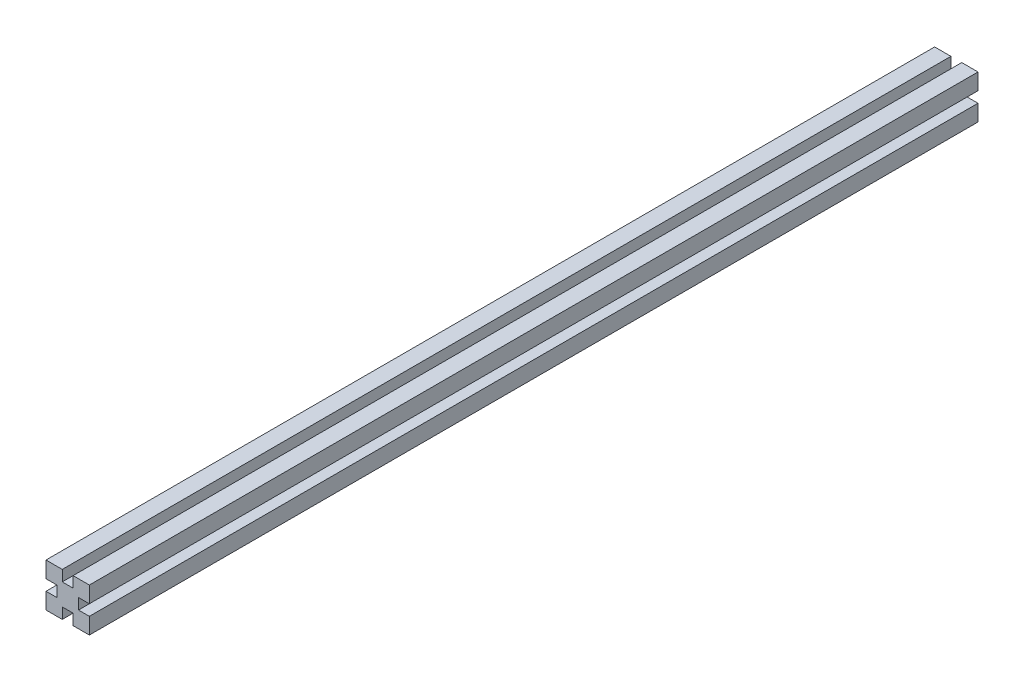
ISO-10303-21;
HEADER;
FILE_DESCRIPTION(('STEP AP214'),'2;1');
FILE_NAME('part.step','',(''),(''),'','','');
FILE_SCHEMA(('AUTOMOTIVE_DESIGN { 1 0 10303 214 1 1 1 1 }'));
ENDSEC;
DATA;
#1=APPLICATION_CONTEXT('core data for automotive mechanical design processes');
#2=APPLICATION_PROTOCOL_DEFINITION('international standard','automotive_design',2000,#1);
#3=PRODUCT_CONTEXT('',#1,'mechanical');
#4=PRODUCT('Part','Part','',(#3));
#5=PRODUCT_RELATED_PRODUCT_CATEGORY('part','',(#4));
#6=PRODUCT_DEFINITION_FORMATION('','',#4);
#7=PRODUCT_DEFINITION_CONTEXT('part definition',#1,'design');
#8=PRODUCT_DEFINITION('design','',#6,#7);
#9=PRODUCT_DEFINITION_SHAPE('','',#8);
#10=(LENGTH_UNIT() NAMED_UNIT(*) SI_UNIT(.MILLI.,.METRE.));
#11=(NAMED_UNIT(*) PLANE_ANGLE_UNIT() SI_UNIT($,.RADIAN.));
#12=(NAMED_UNIT(*) SI_UNIT($,.STERADIAN.) SOLID_ANGLE_UNIT());
#13=UNCERTAINTY_MEASURE_WITH_UNIT(LENGTH_MEASURE(1.E-05),#10,'distance_accuracy_value','');
#14=(GEOMETRIC_REPRESENTATION_CONTEXT(3) GLOBAL_UNCERTAINTY_ASSIGNED_CONTEXT((#13)) GLOBAL_UNIT_ASSIGNED_CONTEXT((#10,
#11,#12)) REPRESENTATION_CONTEXT('',''));
#15=CARTESIAN_POINT('',(0.,0.,0.));
#16=DIRECTION('',(0.,0.,1.));
#17=DIRECTION('',(1.,0.,0.));
#18=AXIS2_PLACEMENT_3D('',#15,#16,#17);
#19=CARTESIAN_POINT('',(0.,0.,-410.));
#20=DIRECTION('',(0.,0.,1.));
#21=DIRECTION('',(1.,0.,0.));
#22=AXIS2_PLACEMENT_3D('',#19,#20,#21);
#23=PLANE('',#22);
#24=DIRECTION('',(-1.,0.,0.));
#25=VECTOR('',#24,1.);
#26=CARTESIAN_POINT('',(0.,-2.5,-410.));
#27=LINE('',#26,#25);
#28=CARTESIAN_POINT('',(10.,-2.50000000000004,-410.));
#29=VERTEX_POINT('',#28);
#30=CARTESIAN_POINT('',(4.99999999999999,-2.50000000000002,-410.));
#31=VERTEX_POINT('',#30);
#32=EDGE_CURVE('E179',#29,#31,#27,.T.);
#33=ORIENTED_EDGE('',*,*,#32,.F.);
#34=DIRECTION('',(0.,-1.,0.));
#35=VECTOR('',#34,1.);
#36=CARTESIAN_POINT('',(10.,0.,-410.));
#37=LINE('',#36,#35);
#38=CARTESIAN_POINT('',(10.,-10.,-410.));
#39=VERTEX_POINT('',#38);
#40=EDGE_CURVE('E277',#29,#39,#37,.T.);
#41=ORIENTED_EDGE('',*,*,#40,.T.);
#42=DIRECTION('',(1.,0.,0.));
#43=VECTOR('',#42,1.);
#44=CARTESIAN_POINT('',(0.,-10.,-410.));
#45=LINE('',#44,#43);
#46=CARTESIAN_POINT('',(2.5,-10.,-410.));
#47=VERTEX_POINT('',#46);
#48=EDGE_CURVE('E273',#47,#39,#45,.T.);
#49=ORIENTED_EDGE('',*,*,#48,.F.);
#50=DIRECTION('',(0.,1.,0.));
#51=VECTOR('',#50,1.);
#52=CARTESIAN_POINT('',(2.5,0.,-410.));
#53=LINE('',#52,#51);
#54=CARTESIAN_POINT('',(2.5,-5.,-410.));
#55=VERTEX_POINT('',#54);
#56=EDGE_CURVE('E58',#47,#55,#53,.T.);
#57=ORIENTED_EDGE('',*,*,#56,.T.);
#58=DIRECTION('',(-1.,0.,0.));
#59=VECTOR('',#58,1.);
#60=CARTESIAN_POINT('',(0.,-5.,-410.));
#61=LINE('',#60,#59);
#62=CARTESIAN_POINT('',(-2.5,-5.,-410.));
#63=VERTEX_POINT('',#62);
#64=EDGE_CURVE('E239',#55,#63,#61,.T.);
#65=ORIENTED_EDGE('',*,*,#64,.T.);
#66=DIRECTION('',(0.,1.,0.));
#67=VECTOR('',#66,1.);
#68=CARTESIAN_POINT('',(-2.5,0.,-410.));
#69=LINE('',#68,#67);
#70=CARTESIAN_POINT('',(-2.5,-10.,-410.));
#71=VERTEX_POINT('',#70);
#72=EDGE_CURVE('E232',#71,#63,#69,.T.);
#73=ORIENTED_EDGE('',*,*,#72,.F.);
#74=CARTESIAN_POINT('',(-10.,-10.,-410.));
#75=VERTEX_POINT('',#74);
#76=EDGE_CURVE('E274',#75,#71,#45,.T.);
#77=ORIENTED_EDGE('',*,*,#76,.F.);
#78=DIRECTION('',(0.,-1.,0.));
#79=VECTOR('',#78,1.);
#80=CARTESIAN_POINT('',(-10.,0.,-410.));
#81=LINE('',#80,#79);
#82=CARTESIAN_POINT('',(-10.,-2.49999999999989,-410.));
#83=VERTEX_POINT('',#82);
#84=EDGE_CURVE('E268',#83,#75,#81,.T.);
#85=ORIENTED_EDGE('',*,*,#84,.F.);
#86=DIRECTION('',(1.,0.,0.));
#87=VECTOR('',#86,1.);
#88=CARTESIAN_POINT('',(0.,-2.5,-410.));
#89=LINE('',#88,#87);
#90=CARTESIAN_POINT('',(-5.00000000000002,-2.49999999999995,-410.));
#91=VERTEX_POINT('',#90);
#92=EDGE_CURVE('E182',#83,#91,#89,.T.);
#93=ORIENTED_EDGE('',*,*,#92,.T.);
#94=DIRECTION('',(0.,1.,0.));
#95=VECTOR('',#94,1.);
#96=CARTESIAN_POINT('',(-5.,0.,-410.));
#97=LINE('',#96,#95);
#98=CARTESIAN_POINT('',(-4.99999999999997,2.50000000000005,-410.));
#99=VERTEX_POINT('',#98);
#100=EDGE_CURVE('E236',#91,#99,#97,.T.);
#101=ORIENTED_EDGE('',*,*,#100,.T.);
#102=DIRECTION('',(1.,0.,0.));
#103=VECTOR('',#102,1.);
#104=CARTESIAN_POINT('',(0.,2.5,-410.));
#105=LINE('',#104,#103);
#106=CARTESIAN_POINT('',(-10.,2.5000000000001,-410.));
#107=VERTEX_POINT('',#106);
#108=EDGE_CURVE('E229',#107,#99,#105,.T.);
#109=ORIENTED_EDGE('',*,*,#108,.F.);
#110=CARTESIAN_POINT('',(-10.,10.,-410.));
#111=VERTEX_POINT('',#110);
#112=EDGE_CURVE('E270',#111,#107,#81,.T.);
#113=ORIENTED_EDGE('',*,*,#112,.F.);
#114=DIRECTION('',(1.,0.,0.));
#115=VECTOR('',#114,1.);
#116=CARTESIAN_POINT('',(0.,10.,-410.));
#117=LINE('',#116,#115);
#118=CARTESIAN_POINT('',(-2.5,10.,-410.));
#119=VERTEX_POINT('',#118);
#120=EDGE_CURVE('E265',#111,#119,#117,.T.);
#121=ORIENTED_EDGE('',*,*,#120,.T.);
#122=DIRECTION('',(0.,-1.,0.));
#123=VECTOR('',#122,1.);
#124=CARTESIAN_POINT('',(-2.5,0.,-410.));
#125=LINE('',#124,#123);
#126=CARTESIAN_POINT('',(-2.5,5.,-410.));
#127=VERTEX_POINT('',#126);
#128=EDGE_CURVE('E251',#119,#127,#125,.T.);
#129=ORIENTED_EDGE('',*,*,#128,.T.);
#130=DIRECTION('',(1.,0.,0.));
#131=VECTOR('',#130,1.);
#132=CARTESIAN_POINT('',(0.,5.,-410.));
#133=LINE('',#132,#131);
#134=CARTESIAN_POINT('',(2.5,5.,-410.));
#135=VERTEX_POINT('',#134);
#136=EDGE_CURVE('E257',#127,#135,#133,.T.);
#137=ORIENTED_EDGE('',*,*,#136,.T.);
#138=DIRECTION('',(0.,-1.,0.));
#139=VECTOR('',#138,1.);
#140=CARTESIAN_POINT('',(2.5,0.,-410.));
#141=LINE('',#140,#139);
#142=CARTESIAN_POINT('',(2.5,10.,-410.));
#143=VERTEX_POINT('',#142);
#144=EDGE_CURVE('E260',#143,#135,#141,.T.);
#145=ORIENTED_EDGE('',*,*,#144,.F.);
#146=CARTESIAN_POINT('',(10.,10.,-410.));
#147=VERTEX_POINT('',#146);
#148=EDGE_CURVE('E269',#143,#147,#117,.T.);
#149=ORIENTED_EDGE('',*,*,#148,.T.);
#150=CARTESIAN_POINT('',(10.,2.49999999999996,-410.));
#151=VERTEX_POINT('',#150);
#152=EDGE_CURVE('E278',#147,#151,#37,.T.);
#153=ORIENTED_EDGE('',*,*,#152,.T.);
#154=DIRECTION('',(-1.,0.,0.));
#155=VECTOR('',#154,1.);
#156=CARTESIAN_POINT('',(0.,2.5,-410.));
#157=LINE('',#156,#155);
#158=CARTESIAN_POINT('',(5.00000000000001,2.49999999999998,-410.));
#159=VERTEX_POINT('',#158);
#160=EDGE_CURVE('E50',#151,#159,#157,.T.);
#161=ORIENTED_EDGE('',*,*,#160,.T.);
#162=DIRECTION('',(0.,-1.,0.));
#163=VECTOR('',#162,1.);
#164=CARTESIAN_POINT('',(5.,0.,-410.));
#165=LINE('',#164,#163);
#166=EDGE_CURVE('E242',#159,#31,#165,.T.);
#167=ORIENTED_EDGE('',*,*,#166,.T.);
#168=EDGE_LOOP('',(#33,#41,#49,#57,#65,#73,#77,#85,#93,#101,#109,#113,#121,#129,#137,#145,#149,
#153,#161,#167));
#169=FACE_BOUND('',#168,.T.);
#170=ADVANCED_FACE('F35',(#169),#23,.F.);
#171=CARTESIAN_POINT('',(0.,0.,0.));
#172=DIRECTION('',(0.,0.,1.));
#173=DIRECTION('',(1.,0.,0.));
#174=AXIS2_PLACEMENT_3D('',#171,#172,#173);
#175=PLANE('',#174);
#176=DIRECTION('',(0.,-1.,0.));
#177=VECTOR('',#176,1.);
#178=CARTESIAN_POINT('',(10.,0.,0.));
#179=LINE('',#178,#177);
#180=CARTESIAN_POINT('',(10.,-2.50000000000004,0.));
#181=VERTEX_POINT('',#180);
#182=CARTESIAN_POINT('',(10.,-10.,0.));
#183=VERTEX_POINT('',#182);
#184=EDGE_CURVE('E196',#181,#183,#179,.T.);
#185=ORIENTED_EDGE('',*,*,#184,.F.);
#186=DIRECTION('',(-1.,0.,0.));
#187=VECTOR('',#186,1.);
#188=CARTESIAN_POINT('',(15.,-2.50000000000005,0.));
#189=LINE('',#188,#187);
#190=CARTESIAN_POINT('',(4.99999999999999,-2.50000000000002,0.));
#191=VERTEX_POINT('',#190);
#192=EDGE_CURVE('E176',#181,#191,#189,.T.);
#193=ORIENTED_EDGE('',*,*,#192,.T.);
#194=DIRECTION('',(0.,-1.,0.));
#195=VECTOR('',#194,1.);
#196=CARTESIAN_POINT('',(5.00000000000001,2.49999999999998,0.));
#197=LINE('',#196,#195);
#198=CARTESIAN_POINT('',(5.00000000000001,2.49999999999998,0.));
#199=VERTEX_POINT('',#198);
#200=EDGE_CURVE('E186',#199,#191,#197,.T.);
#201=ORIENTED_EDGE('',*,*,#200,.F.);
#202=DIRECTION('',(-1.,0.,0.));
#203=VECTOR('',#202,1.);
#204=CARTESIAN_POINT('',(15.,2.49999999999995,0.));
#205=LINE('',#204,#203);
#206=CARTESIAN_POINT('',(10.,2.49999999999996,0.));
#207=VERTEX_POINT('',#206);
#208=EDGE_CURVE('E191',#207,#199,#205,.T.);
#209=ORIENTED_EDGE('',*,*,#208,.F.);
#210=CARTESIAN_POINT('',(10.,10.,0.));
#211=VERTEX_POINT('',#210);
#212=EDGE_CURVE('E293',#211,#207,#179,.T.);
#213=ORIENTED_EDGE('',*,*,#212,.F.);
#214=DIRECTION('',(1.,0.,0.));
#215=VECTOR('',#214,1.);
#216=CARTESIAN_POINT('',(0.,10.,0.));
#217=LINE('',#216,#215);
#218=CARTESIAN_POINT('',(2.5,10.,0.));
#219=VERTEX_POINT('',#218);
#220=EDGE_CURVE('E264',#219,#211,#217,.T.);
#221=ORIENTED_EDGE('',*,*,#220,.F.);
#222=DIRECTION('',(0.,-1.,0.));
#223=VECTOR('',#222,1.);
#224=CARTESIAN_POINT('',(2.5,0.,0.));
#225=LINE('',#224,#223);
#226=CARTESIAN_POINT('',(2.5,5.,0.));
#227=VERTEX_POINT('',#226);
#228=EDGE_CURVE('E309',#219,#227,#225,.T.);
#229=ORIENTED_EDGE('',*,*,#228,.T.);
#230=DIRECTION('',(1.,0.,0.));
#231=VECTOR('',#230,1.);
#232=CARTESIAN_POINT('',(-2.5,5.,0.));
#233=LINE('',#232,#231);
#234=CARTESIAN_POINT('',(-2.5,5.,0.));
#235=VERTEX_POINT('',#234);
#236=EDGE_CURVE('E244',#235,#227,#233,.T.);
#237=ORIENTED_EDGE('',*,*,#236,.F.);
#238=DIRECTION('',(0.,-1.,0.));
#239=VECTOR('',#238,1.);
#240=CARTESIAN_POINT('',(-2.5,0.,0.));
#241=LINE('',#240,#239);
#242=CARTESIAN_POINT('',(-2.5,10.,0.));
#243=VERTEX_POINT('',#242);
#244=EDGE_CURVE('E299',#243,#235,#241,.T.);
#245=ORIENTED_EDGE('',*,*,#244,.F.);
#246=CARTESIAN_POINT('',(-10.,10.,0.));
#247=VERTEX_POINT('',#246);
#248=EDGE_CURVE('E282',#247,#243,#217,.T.);
#249=ORIENTED_EDGE('',*,*,#248,.F.);
#250=DIRECTION('',(0.,-1.,0.));
#251=VECTOR('',#250,1.);
#252=CARTESIAN_POINT('',(-10.,0.,0.));
#253=LINE('',#252,#251);
#254=CARTESIAN_POINT('',(-10.,2.50000000000011,0.));
#255=VERTEX_POINT('',#254);
#256=EDGE_CURVE('E286',#247,#255,#253,.T.);
#257=ORIENTED_EDGE('',*,*,#256,.T.);
#258=DIRECTION('',(1.,0.,0.));
#259=VECTOR('',#258,1.);
#260=CARTESIAN_POINT('',(-15.,2.50000000000016,0.));
#261=LINE('',#260,#259);
#262=CARTESIAN_POINT('',(-4.99999999999997,2.50000000000005,0.));
#263=VERTEX_POINT('',#262);
#264=EDGE_CURVE('E215',#255,#263,#261,.T.);
#265=ORIENTED_EDGE('',*,*,#264,.T.);
#266=DIRECTION('',(0.,1.,0.));
#267=VECTOR('',#266,1.);
#268=CARTESIAN_POINT('',(-5.00000000000002,-2.49999999999995,0.));
#269=LINE('',#268,#267);
#270=CARTESIAN_POINT('',(-5.00000000000002,-2.49999999999995,0.));
#271=VERTEX_POINT('',#270);
#272=EDGE_CURVE('E218',#271,#263,#269,.T.);
#273=ORIENTED_EDGE('',*,*,#272,.F.);
#274=DIRECTION('',(1.,0.,0.));
#275=VECTOR('',#274,1.);
#276=CARTESIAN_POINT('',(-15.,-2.49999999999984,0.));
#277=LINE('',#276,#275);
#278=CARTESIAN_POINT('',(-10.,-2.49999999999989,0.));
#279=VERTEX_POINT('',#278);
#280=EDGE_CURVE('E221',#279,#271,#277,.T.);
#281=ORIENTED_EDGE('',*,*,#280,.F.);
#282=CARTESIAN_POINT('',(-10.,-10.,0.));
#283=VERTEX_POINT('',#282);
#284=EDGE_CURVE('E285',#279,#283,#253,.T.);
#285=ORIENTED_EDGE('',*,*,#284,.T.);
#286=DIRECTION('',(1.,0.,0.));
#287=VECTOR('',#286,1.);
#288=CARTESIAN_POINT('',(0.,-10.,0.));
#289=LINE('',#288,#287);
#290=CARTESIAN_POINT('',(-2.5,-10.,0.));
#291=VERTEX_POINT('',#290);
#292=EDGE_CURVE('E290',#283,#291,#289,.T.);
#293=ORIENTED_EDGE('',*,*,#292,.T.);
#294=DIRECTION('',(0.,1.,0.));
#295=VECTOR('',#294,1.);
#296=CARTESIAN_POINT('',(-2.5,-15.,0.));
#297=LINE('',#296,#295);
#298=CARTESIAN_POINT('',(-2.5,-5.,0.));
#299=VERTEX_POINT('',#298);
#300=EDGE_CURVE('E204',#291,#299,#297,.T.);
#301=ORIENTED_EDGE('',*,*,#300,.T.);
#302=DIRECTION('',(-1.,0.,0.));
#303=VECTOR('',#302,1.);
#304=CARTESIAN_POINT('',(2.5,-5.,0.));
#305=LINE('',#304,#303);
#306=CARTESIAN_POINT('',(2.5,-5.,0.));
#307=VERTEX_POINT('',#306);
#308=EDGE_CURVE('E207',#307,#299,#305,.T.);
#309=ORIENTED_EDGE('',*,*,#308,.F.);
#310=DIRECTION('',(0.,1.,0.));
#311=VECTOR('',#310,1.);
#312=CARTESIAN_POINT('',(2.5,-15.,0.));
#313=LINE('',#312,#311);
#314=CARTESIAN_POINT('',(2.5,-10.,0.));
#315=VERTEX_POINT('',#314);
#316=EDGE_CURVE('E211',#315,#307,#313,.T.);
#317=ORIENTED_EDGE('',*,*,#316,.F.);
#318=EDGE_CURVE('E289',#315,#183,#289,.T.);
#319=ORIENTED_EDGE('',*,*,#318,.T.);
#320=EDGE_LOOP('',(#185,#193,#201,#209,#213,#221,#229,#237,#245,#249,#257,#265,#273,#281,#285,
#293,#301,#309,#317,#319));
#321=FACE_BOUND('',#320,.T.);
#322=ADVANCED_FACE('F194',(#321),#175,.T.);
#323=CARTESIAN_POINT('',(10.,0.,-410.));
#324=DIRECTION('',(-1.,0.,0.));
#325=DIRECTION('',(0.,0.,1.));
#326=AXIS2_PLACEMENT_3D('',#323,#324,#325);
#327=PLANE('',#326);
#328=DIRECTION('',(0.,0.,-1.));
#329=VECTOR('',#328,1.);
#330=CARTESIAN_POINT('',(10.,-2.50000000000004,-410.));
#331=LINE('',#330,#329);
#332=EDGE_CURVE('E11',#181,#29,#331,.T.);
#333=ORIENTED_EDGE('',*,*,#332,.F.);
#334=ORIENTED_EDGE('',*,*,#184,.T.);
#335=DIRECTION('',(0.,0.,1.));
#336=VECTOR('',#335,1.);
#337=CARTESIAN_POINT('',(10.,-10.,-410.));
#338=LINE('',#337,#336);
#339=EDGE_CURVE('E300',#39,#183,#338,.T.);
#340=ORIENTED_EDGE('',*,*,#339,.F.);
#341=ORIENTED_EDGE('',*,*,#40,.F.);
#342=EDGE_LOOP('',(#333,#334,#340,#341));
#343=FACE_BOUND('',#342,.T.);
#344=ADVANCED_FACE('F346',(#343),#327,.F.);
#345=CARTESIAN_POINT('',(0.,-10.,-410.));
#346=DIRECTION('',(0.,-1.,0.));
#347=DIRECTION('',(0.,0.,-1.));
#348=AXIS2_PLACEMENT_3D('',#345,#346,#347);
#349=PLANE('',#348);
#350=ORIENTED_EDGE('',*,*,#76,.T.);
#351=DIRECTION('',(0.,0.,1.));
#352=VECTOR('',#351,1.);
#353=CARTESIAN_POINT('',(-2.5,-10.,-410.));
#354=LINE('',#353,#352);
#355=EDGE_CURVE('E319',#71,#291,#354,.T.);
#356=ORIENTED_EDGE('',*,*,#355,.T.);
#357=ORIENTED_EDGE('',*,*,#292,.F.);
#358=DIRECTION('',(0.,0.,1.));
#359=VECTOR('',#358,1.);
#360=CARTESIAN_POINT('',(-10.,-10.,-410.));
#361=LINE('',#360,#359);
#362=EDGE_CURVE('E303',#75,#283,#361,.T.);
#363=ORIENTED_EDGE('',*,*,#362,.F.);
#364=EDGE_LOOP('',(#350,#356,#357,#363));
#365=FACE_BOUND('',#364,.T.);
#366=ADVANCED_FACE('F358',(#365),#349,.T.);
#367=CARTESIAN_POINT('',(-10.,0.,-410.));
#368=DIRECTION('',(-1.,0.,0.));
#369=DIRECTION('',(0.,-1.,0.));
#370=AXIS2_PLACEMENT_3D('',#367,#368,#369);
#371=PLANE('',#370);
#372=ORIENTED_EDGE('',*,*,#112,.T.);
#373=DIRECTION('',(0.,0.,1.));
#374=VECTOR('',#373,1.);
#375=CARTESIAN_POINT('',(-10.,2.5000000000001,-410.));
#376=LINE('',#375,#374);
#377=EDGE_CURVE('E314',#107,#255,#376,.T.);
#378=ORIENTED_EDGE('',*,*,#377,.T.);
#379=ORIENTED_EDGE('',*,*,#256,.F.);
#380=DIRECTION('',(0.,0.,1.));
#381=VECTOR('',#380,1.);
#382=CARTESIAN_POINT('',(-10.,10.,-410.));
#383=LINE('',#382,#381);
#384=EDGE_CURVE('E281',#111,#247,#383,.T.);
#385=ORIENTED_EDGE('',*,*,#384,.F.);
#386=EDGE_LOOP('',(#372,#378,#379,#385));
#387=FACE_BOUND('',#386,.T.);
#388=ADVANCED_FACE('F361',(#387),#371,.T.);
#389=CARTESIAN_POINT('',(0.,10.,-410.));
#390=DIRECTION('',(0.,-1.,0.));
#391=DIRECTION('',(0.,0.,-1.));
#392=AXIS2_PLACEMENT_3D('',#389,#390,#391);
#393=PLANE('',#392);
#394=DIRECTION('',(0.,0.,-1.));
#395=VECTOR('',#394,1.);
#396=CARTESIAN_POINT('',(2.5,10.,-410.));
#397=LINE('',#396,#395);
#398=EDGE_CURVE('E262',#219,#143,#397,.T.);
#399=ORIENTED_EDGE('',*,*,#398,.F.);
#400=ORIENTED_EDGE('',*,*,#220,.T.);
#401=DIRECTION('',(0.,0.,1.));
#402=VECTOR('',#401,1.);
#403=CARTESIAN_POINT('',(10.,10.,-410.));
#404=LINE('',#403,#402);
#405=EDGE_CURVE('E296',#147,#211,#404,.T.);
#406=ORIENTED_EDGE('',*,*,#405,.F.);
#407=ORIENTED_EDGE('',*,*,#148,.F.);
#408=EDGE_LOOP('',(#399,#400,#406,#407));
#409=FACE_BOUND('',#408,.T.);
#410=ADVANCED_FACE('F331',(#409),#393,.F.);
#411=ORIENTED_EDGE('',*,*,#248,.T.);
#412=DIRECTION('',(0.,0.,-1.));
#413=VECTOR('',#412,1.);
#414=CARTESIAN_POINT('',(-2.5,10.,-410.));
#415=LINE('',#414,#413);
#416=EDGE_CURVE('E254',#243,#119,#415,.T.);
#417=ORIENTED_EDGE('',*,*,#416,.T.);
#418=ORIENTED_EDGE('',*,*,#120,.F.);
#419=ORIENTED_EDGE('',*,*,#384,.T.);
#420=EDGE_LOOP('',(#411,#417,#418,#419));
#421=FACE_BOUND('',#420,.T.);
#422=ADVANCED_FACE('F37',(#421),#393,.F.);
#423=ORIENTED_EDGE('',*,*,#212,.T.);
#424=DIRECTION('',(0.,0.,-1.));
#425=VECTOR('',#424,1.);
#426=CARTESIAN_POINT('',(10.,2.49999999999996,-410.));
#427=LINE('',#426,#425);
#428=EDGE_CURVE('E43',#207,#151,#427,.T.);
#429=ORIENTED_EDGE('',*,*,#428,.T.);
#430=ORIENTED_EDGE('',*,*,#152,.F.);
#431=ORIENTED_EDGE('',*,*,#405,.T.);
#432=EDGE_LOOP('',(#423,#429,#430,#431));
#433=FACE_BOUND('',#432,.T.);
#434=ADVANCED_FACE('F323',(#433),#327,.F.);
#435=DIRECTION('',(0.,0.,1.));
#436=VECTOR('',#435,1.);
#437=CARTESIAN_POINT('',(2.5,-10.,-410.));
#438=LINE('',#437,#436);
#439=EDGE_CURVE('E317',#47,#315,#438,.T.);
#440=ORIENTED_EDGE('',*,*,#439,.F.);
#441=ORIENTED_EDGE('',*,*,#48,.T.);
#442=ORIENTED_EDGE('',*,*,#339,.T.);
#443=ORIENTED_EDGE('',*,*,#318,.F.);
#444=EDGE_LOOP('',(#440,#441,#442,#443));
#445=FACE_BOUND('',#444,.T.);
#446=ADVANCED_FACE('F354',(#445),#349,.T.);
#447=DIRECTION('',(0.,0.,1.));
#448=VECTOR('',#447,1.);
#449=CARTESIAN_POINT('',(-10.,-2.49999999999989,-410.));
#450=LINE('',#449,#448);
#451=EDGE_CURVE('E312',#83,#279,#450,.T.);
#452=ORIENTED_EDGE('',*,*,#451,.F.);
#453=ORIENTED_EDGE('',*,*,#84,.T.);
#454=ORIENTED_EDGE('',*,*,#362,.T.);
#455=ORIENTED_EDGE('',*,*,#284,.F.);
#456=EDGE_LOOP('',(#452,#453,#454,#455));
#457=FACE_BOUND('',#456,.T.);
#458=ADVANCED_FACE('F356',(#457),#371,.T.);
#459=CARTESIAN_POINT('',(2.5,15.,-645.));
#460=DIRECTION('',(-1.,0.,0.));
#461=DIRECTION('',(0.,-1.,0.));
#462=AXIS2_PLACEMENT_3D('',#459,#460,#461);
#463=PLANE('',#462);
#464=ORIENTED_EDGE('',*,*,#398,.T.);
#465=ORIENTED_EDGE('',*,*,#144,.T.);
#466=DIRECTION('',(0.,0.,1.));
#467=VECTOR('',#466,1.);
#468=CARTESIAN_POINT('',(2.5,5.,-645.));
#469=LINE('',#468,#467);
#470=EDGE_CURVE('E249',#135,#227,#469,.T.);
#471=ORIENTED_EDGE('',*,*,#470,.T.);
#472=ORIENTED_EDGE('',*,*,#228,.F.);
#473=EDGE_LOOP('',(#464,#465,#471,#472));
#474=FACE_BOUND('',#473,.T.);
#475=ADVANCED_FACE('F349',(#474),#463,.T.);
#476=CARTESIAN_POINT('',(-2.5,5.,-645.));
#477=DIRECTION('',(0.,-1.,0.));
#478=DIRECTION('',(0.,0.,-1.));
#479=AXIS2_PLACEMENT_3D('',#476,#477,#478);
#480=PLANE('',#479);
#481=DIRECTION('',(0.,0.,1.));
#482=VECTOR('',#481,1.);
#483=CARTESIAN_POINT('',(-2.5,5.,-645.));
#484=LINE('',#483,#482);
#485=EDGE_CURVE('E247',#127,#235,#484,.T.);
#486=ORIENTED_EDGE('',*,*,#485,.T.);
#487=ORIENTED_EDGE('',*,*,#236,.T.);
#488=ORIENTED_EDGE('',*,*,#470,.F.);
#489=ORIENTED_EDGE('',*,*,#136,.F.);
#490=EDGE_LOOP('',(#486,#487,#488,#489));
#491=FACE_BOUND('',#490,.T.);
#492=ADVANCED_FACE('F365',(#491),#480,.F.);
#493=CARTESIAN_POINT('',(-2.5,15.,-645.));
#494=DIRECTION('',(-1.,0.,0.));
#495=DIRECTION('',(0.,-1.,0.));
#496=AXIS2_PLACEMENT_3D('',#493,#494,#495);
#497=PLANE('',#496);
#498=ORIENTED_EDGE('',*,*,#244,.T.);
#499=ORIENTED_EDGE('',*,*,#485,.F.);
#500=ORIENTED_EDGE('',*,*,#128,.F.);
#501=ORIENTED_EDGE('',*,*,#416,.F.);
#502=EDGE_LOOP('',(#498,#499,#500,#501));
#503=FACE_BOUND('',#502,.T.);
#504=ADVANCED_FACE('F392',(#503),#497,.F.);
#505=CARTESIAN_POINT('',(-5.00000000000002,-2.49999999999995,-645.));
#506=DIRECTION('',(1.,0.,0.));
#507=DIRECTION('',(0.,1.,0.));
#508=AXIS2_PLACEMENT_3D('',#505,#506,#507);
#509=PLANE('',#508);
#510=DIRECTION('',(0.,0.,1.));
#511=VECTOR('',#510,1.);
#512=CARTESIAN_POINT('',(-5.00000000000002,-2.49999999999995,-645.));
#513=LINE('',#512,#511);
#514=EDGE_CURVE('E224',#91,#271,#513,.T.);
#515=ORIENTED_EDGE('',*,*,#514,.T.);
#516=ORIENTED_EDGE('',*,*,#272,.T.);
#517=DIRECTION('',(0.,0.,1.));
#518=VECTOR('',#517,1.);
#519=CARTESIAN_POINT('',(-4.99999999999997,2.50000000000005,-645.));
#520=LINE('',#519,#518);
#521=EDGE_CURVE('E208',#99,#263,#520,.T.);
#522=ORIENTED_EDGE('',*,*,#521,.F.);
#523=ORIENTED_EDGE('',*,*,#100,.F.);
#524=EDGE_LOOP('',(#515,#516,#522,#523));
#525=FACE_BOUND('',#524,.T.);
#526=ADVANCED_FACE('F383',(#525),#509,.F.);
#527=CARTESIAN_POINT('',(-15.,2.50000000000016,-645.));
#528=DIRECTION('',(0.,-1.,0.));
#529=DIRECTION('',(1.,0.,0.));
#530=AXIS2_PLACEMENT_3D('',#527,#528,#529);
#531=PLANE('',#530);
#532=ORIENTED_EDGE('',*,*,#108,.T.);
#533=ORIENTED_EDGE('',*,*,#521,.T.);
#534=ORIENTED_EDGE('',*,*,#264,.F.);
#535=ORIENTED_EDGE('',*,*,#377,.F.);
#536=EDGE_LOOP('',(#532,#533,#534,#535));
#537=FACE_BOUND('',#536,.T.);
#538=ADVANCED_FACE('F381',(#537),#531,.T.);
#539=CARTESIAN_POINT('',(-15.,-2.49999999999984,-645.));
#540=DIRECTION('',(0.,-1.,0.));
#541=DIRECTION('',(1.,0.,0.));
#542=AXIS2_PLACEMENT_3D('',#539,#540,#541);
#543=PLANE('',#542);
#544=ORIENTED_EDGE('',*,*,#451,.T.);
#545=ORIENTED_EDGE('',*,*,#280,.T.);
#546=ORIENTED_EDGE('',*,*,#514,.F.);
#547=ORIENTED_EDGE('',*,*,#92,.F.);
#548=EDGE_LOOP('',(#544,#545,#546,#547));
#549=FACE_BOUND('',#548,.T.);
#550=ADVANCED_FACE('F404',(#549),#543,.F.);
#551=CARTESIAN_POINT('',(2.5,-5.,-645.));
#552=DIRECTION('',(0.,1.,0.));
#553=DIRECTION('',(0.,0.,1.));
#554=AXIS2_PLACEMENT_3D('',#551,#552,#553);
#555=PLANE('',#554);
#556=DIRECTION('',(0.,0.,1.));
#557=VECTOR('',#556,1.);
#558=CARTESIAN_POINT('',(2.5,-5.,-645.));
#559=LINE('',#558,#557);
#560=EDGE_CURVE('E199',#55,#307,#559,.T.);
#561=ORIENTED_EDGE('',*,*,#560,.T.);
#562=ORIENTED_EDGE('',*,*,#308,.T.);
#563=DIRECTION('',(0.,0.,1.));
#564=VECTOR('',#563,1.);
#565=CARTESIAN_POINT('',(-2.5,-5.,-645.));
#566=LINE('',#565,#564);
#567=EDGE_CURVE('E197',#63,#299,#566,.T.);
#568=ORIENTED_EDGE('',*,*,#567,.F.);
#569=ORIENTED_EDGE('',*,*,#64,.F.);
#570=EDGE_LOOP('',(#561,#562,#568,#569));
#571=FACE_BOUND('',#570,.T.);
#572=ADVANCED_FACE('F409',(#571),#555,.F.);
#573=CARTESIAN_POINT('',(-2.5,-15.,-645.));
#574=DIRECTION('',(1.,0.,0.));
#575=DIRECTION('',(0.,1.,0.));
#576=AXIS2_PLACEMENT_3D('',#573,#574,#575);
#577=PLANE('',#576);
#578=ORIENTED_EDGE('',*,*,#72,.T.);
#579=ORIENTED_EDGE('',*,*,#567,.T.);
#580=ORIENTED_EDGE('',*,*,#300,.F.);
#581=ORIENTED_EDGE('',*,*,#355,.F.);
#582=EDGE_LOOP('',(#578,#579,#580,#581));
#583=FACE_BOUND('',#582,.T.);
#584=ADVANCED_FACE('F411',(#583),#577,.T.);
#585=CARTESIAN_POINT('',(2.5,-15.,-645.));
#586=DIRECTION('',(1.,0.,0.));
#587=DIRECTION('',(0.,1.,0.));
#588=AXIS2_PLACEMENT_3D('',#585,#586,#587);
#589=PLANE('',#588);
#590=ORIENTED_EDGE('',*,*,#439,.T.);
#591=ORIENTED_EDGE('',*,*,#316,.T.);
#592=ORIENTED_EDGE('',*,*,#560,.F.);
#593=ORIENTED_EDGE('',*,*,#56,.F.);
#594=EDGE_LOOP('',(#590,#591,#592,#593));
#595=FACE_BOUND('',#594,.T.);
#596=ADVANCED_FACE('F414',(#595),#589,.F.);
#597=CARTESIAN_POINT('',(5.00000000000001,2.49999999999998,-645.));
#598=DIRECTION('',(-1.,0.,0.));
#599=DIRECTION('',(0.,-1.,0.));
#600=AXIS2_PLACEMENT_3D('',#597,#598,#599);
#601=PLANE('',#600);
#602=DIRECTION('',(0.,0.,1.));
#603=VECTOR('',#602,1.);
#604=CARTESIAN_POINT('',(5.00000000000001,2.49999999999998,-645.));
#605=LINE('',#604,#603);
#606=EDGE_CURVE('E183',#159,#199,#605,.T.);
#607=ORIENTED_EDGE('',*,*,#606,.T.);
#608=ORIENTED_EDGE('',*,*,#200,.T.);
#609=DIRECTION('',(0.,0.,1.));
#610=VECTOR('',#609,1.);
#611=CARTESIAN_POINT('',(4.99999999999999,-2.50000000000002,-645.));
#612=LINE('',#611,#610);
#613=EDGE_CURVE('E172',#31,#191,#612,.T.);
#614=ORIENTED_EDGE('',*,*,#613,.F.);
#615=ORIENTED_EDGE('',*,*,#166,.F.);
#616=EDGE_LOOP('',(#607,#608,#614,#615));
#617=FACE_BOUND('',#616,.T.);
#618=ADVANCED_FACE('F187',(#617),#601,.F.);
#619=CARTESIAN_POINT('',(15.,-2.50000000000005,-645.));
#620=DIRECTION('',(0.,1.,0.));
#621=DIRECTION('',(-1.,0.,0.));
#622=AXIS2_PLACEMENT_3D('',#619,#620,#621);
#623=PLANE('',#622);
#624=ORIENTED_EDGE('',*,*,#32,.T.);
#625=ORIENTED_EDGE('',*,*,#613,.T.);
#626=ORIENTED_EDGE('',*,*,#192,.F.);
#627=ORIENTED_EDGE('',*,*,#332,.T.);
#628=EDGE_LOOP('',(#624,#625,#626,#627));
#629=FACE_BOUND('',#628,.T.);
#630=ADVANCED_FACE('F174',(#629),#623,.T.);
#631=CARTESIAN_POINT('',(15.,2.49999999999995,-645.));
#632=DIRECTION('',(0.,1.,0.));
#633=DIRECTION('',(-1.,0.,0.));
#634=AXIS2_PLACEMENT_3D('',#631,#632,#633);
#635=PLANE('',#634);
#636=ORIENTED_EDGE('',*,*,#428,.F.);
#637=ORIENTED_EDGE('',*,*,#208,.T.);
#638=ORIENTED_EDGE('',*,*,#606,.F.);
#639=ORIENTED_EDGE('',*,*,#160,.F.);
#640=EDGE_LOOP('',(#636,#637,#638,#639));
#641=FACE_BOUND('',#640,.T.);
#642=ADVANCED_FACE('F333',(#641),#635,.F.);
#643=CLOSED_SHELL('',(#170,#322,#344,#366,#388,#410,#422,#434,#446,#458,#475,#492,#504,#526,
#538,#550,#572,#584,#596,#618,#630,#642));
#644=MANIFOLD_SOLID_BREP('B2',#643);
#645=ADVANCED_BREP_SHAPE_REPRESENTATION('',(#18,#644),#14);
#646=SHAPE_DEFINITION_REPRESENTATION(#9,#645);
ENDSEC;
END-ISO-10303-21;
